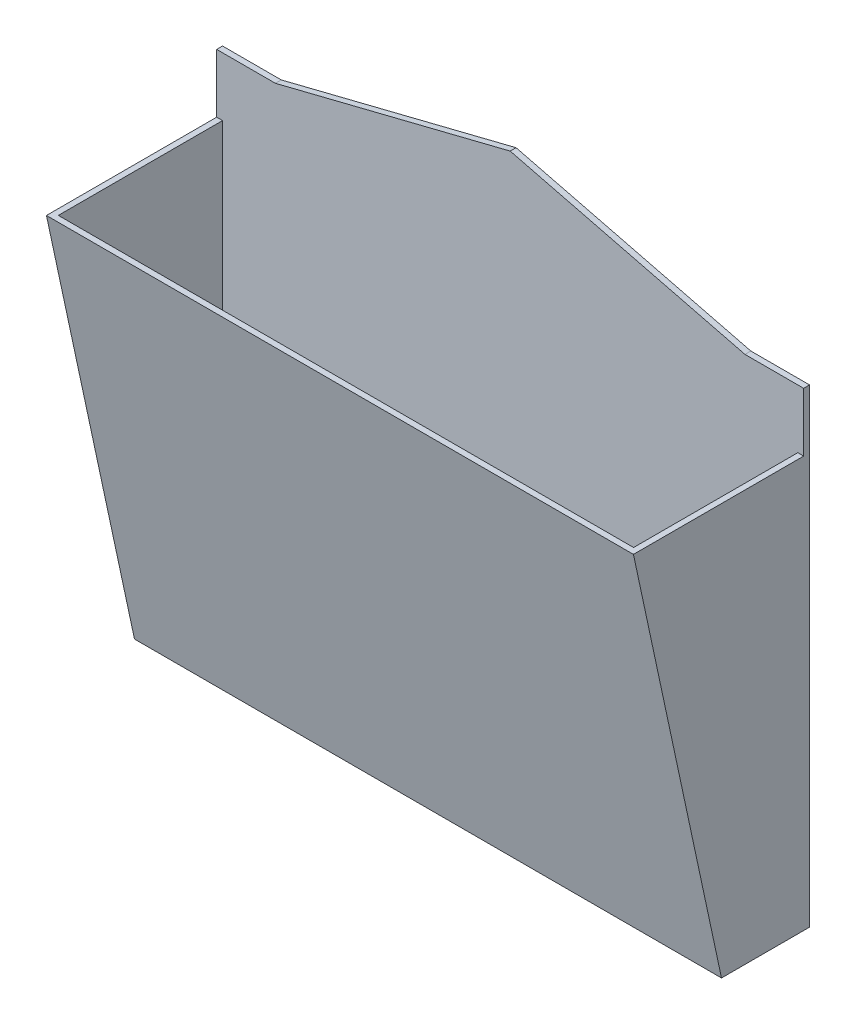
ISO-10303-21;
HEADER;
FILE_DESCRIPTION(('STEP AP214'),'2;1');
FILE_NAME('part.step','',(''),(''),'','','');
FILE_SCHEMA(('AUTOMOTIVE_DESIGN { 1 0 10303 214 1 1 1 1 }'));
ENDSEC;
DATA;
#1=APPLICATION_CONTEXT('core data for automotive mechanical design processes');
#2=APPLICATION_PROTOCOL_DEFINITION('international standard','automotive_design',2000,#1);
#3=PRODUCT_CONTEXT('',#1,'mechanical');
#4=PRODUCT('Part','Part','',(#3));
#5=PRODUCT_RELATED_PRODUCT_CATEGORY('part','',(#4));
#6=PRODUCT_DEFINITION_FORMATION('','',#4);
#7=PRODUCT_DEFINITION_CONTEXT('part definition',#1,'design');
#8=PRODUCT_DEFINITION('design','',#6,#7);
#9=PRODUCT_DEFINITION_SHAPE('','',#8);
#10=(LENGTH_UNIT() NAMED_UNIT(*) SI_UNIT(.MILLI.,.METRE.));
#11=(NAMED_UNIT(*) PLANE_ANGLE_UNIT() SI_UNIT($,.RADIAN.));
#12=(NAMED_UNIT(*) SI_UNIT($,.STERADIAN.) SOLID_ANGLE_UNIT());
#13=UNCERTAINTY_MEASURE_WITH_UNIT(LENGTH_MEASURE(1.E-05),#10,'distance_accuracy_value','');
#14=(GEOMETRIC_REPRESENTATION_CONTEXT(3) GLOBAL_UNCERTAINTY_ASSIGNED_CONTEXT((#13)) GLOBAL_UNIT_ASSIGNED_CONTEXT((#10,
#11,#12)) REPRESENTATION_CONTEXT('',''));
#15=CARTESIAN_POINT('',(0.,0.,0.));
#16=DIRECTION('',(0.,0.,1.));
#17=DIRECTION('',(1.,0.,0.));
#18=AXIS2_PLACEMENT_3D('',#15,#16,#17);
#19=CARTESIAN_POINT('',(0.,70.,30.));
#20=DIRECTION('',(0.,-1.,0.));
#21=DIRECTION('',(0.,0.,-1.));
#22=AXIS2_PLACEMENT_3D('',#19,#20,#21);
#23=PLANE('',#22);
#24=DIRECTION('',(-1.,0.,0.));
#25=VECTOR('',#24,1.);
#26=CARTESIAN_POINT('',(0.,70.,28.9772984954803));
#27=LINE('',#26,#25);
#28=CARTESIAN_POINT('',(99.,70.,28.9772984954803));
#29=VERTEX_POINT('',#28);
#30=CARTESIAN_POINT('',(1.,70.,28.9772984954803));
#31=VERTEX_POINT('',#30);
#32=EDGE_CURVE('E49',#29,#31,#27,.T.);
#33=ORIENTED_EDGE('',*,*,#32,.T.);
#34=DIRECTION('',(0.,0.,-1.));
#35=VECTOR('',#34,1.);
#36=CARTESIAN_POINT('',(1.,70.,30.));
#37=LINE('',#36,#35);
#38=CARTESIAN_POINT('',(1.,70.,1.));
#39=VERTEX_POINT('',#38);
#40=EDGE_CURVE('E162',#31,#39,#37,.T.);
#41=ORIENTED_EDGE('',*,*,#40,.T.);
#42=DIRECTION('',(1.,0.,0.));
#43=VECTOR('',#42,1.);
#44=CARTESIAN_POINT('',(0.,70.,1.));
#45=LINE('',#44,#43);
#46=CARTESIAN_POINT('',(0.,70.,1.));
#47=VERTEX_POINT('',#46);
#48=EDGE_CURVE('E57',#47,#39,#45,.T.);
#49=ORIENTED_EDGE('',*,*,#48,.F.);
#50=DIRECTION('',(0.,0.,-1.));
#51=VECTOR('',#50,1.);
#52=CARTESIAN_POINT('',(0.,70.,30.));
#53=LINE('',#52,#51);
#54=CARTESIAN_POINT('',(0.,70.,30.));
#55=VERTEX_POINT('',#54);
#56=EDGE_CURVE('E201',#55,#47,#53,.T.);
#57=ORIENTED_EDGE('',*,*,#56,.F.);
#58=DIRECTION('',(-1.,0.,0.));
#59=VECTOR('',#58,1.);
#60=CARTESIAN_POINT('',(0.,70.,30.));
#61=LINE('',#60,#59);
#62=CARTESIAN_POINT('',(100.,70.,30.));
#63=VERTEX_POINT('',#62);
#64=EDGE_CURVE('E198',#63,#55,#61,.T.);
#65=ORIENTED_EDGE('',*,*,#64,.F.);
#66=DIRECTION('',(0.,0.,-1.));
#67=VECTOR('',#66,1.);
#68=CARTESIAN_POINT('',(100.,70.,30.));
#69=LINE('',#68,#67);
#70=CARTESIAN_POINT('',(100.,70.,1.));
#71=VERTEX_POINT('',#70);
#72=EDGE_CURVE('E183',#63,#71,#69,.T.);
#73=ORIENTED_EDGE('',*,*,#72,.T.);
#74=CARTESIAN_POINT('',(99.,70.,1.));
#75=VERTEX_POINT('',#74);
#76=EDGE_CURVE('E35',#75,#71,#45,.T.);
#77=ORIENTED_EDGE('',*,*,#76,.F.);
#78=DIRECTION('',(0.,0.,-1.));
#79=VECTOR('',#78,1.);
#80=CARTESIAN_POINT('',(99.,70.,30.));
#81=LINE('',#80,#79);
#82=EDGE_CURVE('E164',#29,#75,#81,.T.);
#83=ORIENTED_EDGE('',*,*,#82,.F.);
#84=EDGE_LOOP('',(#33,#41,#49,#57,#65,#73,#77,#83));
#85=FACE_BOUND('',#84,.T.);
#86=ADVANCED_FACE('F31',(#85),#23,.F.);
#87=CARTESIAN_POINT('',(0.,0.,30.));
#88=DIRECTION('',(1.,0.,0.));
#89=DIRECTION('',(0.,0.,-1.));
#90=AXIS2_PLACEMENT_3D('',#87,#88,#89);
#91=PLANE('',#90);
#92=DIRECTION('',(0.,0.,-1.));
#93=VECTOR('',#92,1.);
#94=CARTESIAN_POINT('',(0.,0.,30.));
#95=LINE('',#94,#93);
#96=CARTESIAN_POINT('',(0.,0.,15.));
#97=VERTEX_POINT('',#96);
#98=CARTESIAN_POINT('',(0.,0.,0.));
#99=VERTEX_POINT('',#98);
#100=EDGE_CURVE('E11',#97,#99,#95,.T.);
#101=ORIENTED_EDGE('',*,*,#100,.F.);
#102=DIRECTION('',(0.,0.97780241407741,0.209529088730873));
#103=VECTOR('',#102,1.);
#104=CARTESIAN_POINT('',(0.,70.,30.));
#105=LINE('',#104,#103);
#106=EDGE_CURVE('E233',#97,#55,#105,.T.);
#107=ORIENTED_EDGE('',*,*,#106,.T.);
#108=ORIENTED_EDGE('',*,*,#56,.T.);
#109=DIRECTION('',(0.,-1.,0.));
#110=VECTOR('',#109,1.);
#111=CARTESIAN_POINT('',(0.,80.,1.));
#112=LINE('',#111,#110);
#113=CARTESIAN_POINT('',(0.,80.,1.));
#114=VERTEX_POINT('',#113);
#115=EDGE_CURVE('E173',#114,#47,#112,.T.);
#116=ORIENTED_EDGE('',*,*,#115,.F.);
#117=DIRECTION('',(0.,0.,-1.));
#118=VECTOR('',#117,1.);
#119=CARTESIAN_POINT('',(0.,80.,1.));
#120=LINE('',#119,#118);
#121=CARTESIAN_POINT('',(0.,80.,0.));
#122=VERTEX_POINT('',#121);
#123=EDGE_CURVE('E210',#114,#122,#120,.T.);
#124=ORIENTED_EDGE('',*,*,#123,.T.);
#125=DIRECTION('',(0.,-1.,0.));
#126=VECTOR('',#125,1.);
#127=CARTESIAN_POINT('',(0.,0.,0.));
#128=LINE('',#127,#126);
#129=EDGE_CURVE('E239',#122,#99,#128,.T.);
#130=ORIENTED_EDGE('',*,*,#129,.T.);
#131=EDGE_LOOP('',(#101,#107,#108,#116,#124,#130));
#132=FACE_BOUND('',#131,.T.);
#133=ADVANCED_FACE('F33',(#132),#91,.F.);
#134=CARTESIAN_POINT('',(0.,0.,30.));
#135=DIRECTION('',(0.,1.,0.));
#136=DIRECTION('',(0.,0.,1.));
#137=AXIS2_PLACEMENT_3D('',#134,#135,#136);
#138=PLANE('',#137);
#139=DIRECTION('',(0.,0.,-1.));
#140=VECTOR('',#139,1.);
#141=CARTESIAN_POINT('',(100.,0.,30.));
#142=LINE('',#141,#140);
#143=CARTESIAN_POINT('',(100.,0.,15.));
#144=VERTEX_POINT('',#143);
#145=CARTESIAN_POINT('',(100.,0.,0.));
#146=VERTEX_POINT('',#145);
#147=EDGE_CURVE('E41',#144,#146,#142,.T.);
#148=ORIENTED_EDGE('',*,*,#147,.F.);
#149=DIRECTION('',(1.,0.,0.));
#150=VECTOR('',#149,1.);
#151=CARTESIAN_POINT('',(0.,0.,15.));
#152=LINE('',#151,#150);
#153=EDGE_CURVE('E236',#97,#144,#152,.T.);
#154=ORIENTED_EDGE('',*,*,#153,.F.);
#155=ORIENTED_EDGE('',*,*,#100,.T.);
#156=DIRECTION('',(1.,0.,0.));
#157=VECTOR('',#156,1.);
#158=CARTESIAN_POINT('',(0.,0.,0.));
#159=LINE('',#158,#157);
#160=EDGE_CURVE('E243',#99,#146,#159,.T.);
#161=ORIENTED_EDGE('',*,*,#160,.T.);
#162=EDGE_LOOP('',(#148,#154,#155,#161));
#163=FACE_BOUND('',#162,.T.);
#164=ADVANCED_FACE('F254',(#163),#138,.F.);
#165=CARTESIAN_POINT('',(100.,0.,30.));
#166=DIRECTION('',(-1.,0.,0.));
#167=DIRECTION('',(0.,0.,1.));
#168=AXIS2_PLACEMENT_3D('',#165,#166,#167);
#169=PLANE('',#168);
#170=ORIENTED_EDGE('',*,*,#72,.F.);
#171=DIRECTION('',(0.,0.97780241407741,0.209529088730873));
#172=VECTOR('',#171,1.);
#173=CARTESIAN_POINT('',(100.,70.,30.));
#174=LINE('',#173,#172);
#175=EDGE_CURVE('E232',#144,#63,#174,.T.);
#176=ORIENTED_EDGE('',*,*,#175,.F.);
#177=ORIENTED_EDGE('',*,*,#147,.T.);
#178=DIRECTION('',(0.,1.,0.));
#179=VECTOR('',#178,1.);
#180=CARTESIAN_POINT('',(100.,0.,0.));
#181=LINE('',#180,#179);
#182=CARTESIAN_POINT('',(100.,80.,0.));
#183=VERTEX_POINT('',#182);
#184=EDGE_CURVE('E207',#146,#183,#181,.T.);
#185=ORIENTED_EDGE('',*,*,#184,.T.);
#186=DIRECTION('',(0.,0.,-1.));
#187=VECTOR('',#186,1.);
#188=CARTESIAN_POINT('',(100.,80.,1.));
#189=LINE('',#188,#187);
#190=CARTESIAN_POINT('',(100.,80.,1.));
#191=VERTEX_POINT('',#190);
#192=EDGE_CURVE('E204',#191,#183,#189,.T.);
#193=ORIENTED_EDGE('',*,*,#192,.F.);
#194=DIRECTION('',(0.,1.,0.));
#195=VECTOR('',#194,1.);
#196=CARTESIAN_POINT('',(100.,80.,1.));
#197=LINE('',#196,#195);
#198=EDGE_CURVE('E182',#71,#191,#197,.T.);
#199=ORIENTED_EDGE('',*,*,#198,.F.);
#200=EDGE_LOOP('',(#170,#176,#177,#185,#193,#199));
#201=FACE_BOUND('',#200,.T.);
#202=ADVANCED_FACE('F202',(#201),#169,.F.);
#203=CARTESIAN_POINT('',(0.,70.,0.));
#204=DIRECTION('',(0.,0.,-1.));
#205=DIRECTION('',(-1.,0.,0.));
#206=AXIS2_PLACEMENT_3D('',#203,#204,#205);
#207=PLANE('',#206);
#208=ORIENTED_EDGE('',*,*,#129,.F.);
#209=DIRECTION('',(-1.,0.,0.));
#210=VECTOR('',#209,1.);
#211=CARTESIAN_POINT('',(10.,80.,0.));
#212=LINE('',#211,#210);
#213=CARTESIAN_POINT('',(10.,80.,0.));
#214=VERTEX_POINT('',#213);
#215=EDGE_CURVE('E258',#214,#122,#212,.T.);
#216=ORIENTED_EDGE('',*,*,#215,.F.);
#217=DIRECTION('',(-0.970142500145332,-0.242535625036333,0.));
#218=VECTOR('',#217,1.);
#219=CARTESIAN_POINT('',(50.,90.,0.));
#220=LINE('',#219,#218);
#221=CARTESIAN_POINT('',(50.,90.,0.));
#222=VERTEX_POINT('',#221);
#223=EDGE_CURVE('E260',#222,#214,#220,.T.);
#224=ORIENTED_EDGE('',*,*,#223,.F.);
#225=DIRECTION('',(-0.970142500145332,0.242535625036333,0.));
#226=VECTOR('',#225,1.);
#227=CARTESIAN_POINT('',(50.,90.,0.));
#228=LINE('',#227,#226);
#229=CARTESIAN_POINT('',(90.,80.,0.));
#230=VERTEX_POINT('',#229);
#231=EDGE_CURVE('E149',#230,#222,#228,.T.);
#232=ORIENTED_EDGE('',*,*,#231,.F.);
#233=DIRECTION('',(-1.,0.,0.));
#234=VECTOR('',#233,1.);
#235=CARTESIAN_POINT('',(90.,80.,0.));
#236=LINE('',#235,#234);
#237=EDGE_CURVE('E170',#183,#230,#236,.T.);
#238=ORIENTED_EDGE('',*,*,#237,.F.);
#239=ORIENTED_EDGE('',*,*,#184,.F.);
#240=ORIENTED_EDGE('',*,*,#160,.F.);
#241=EDGE_LOOP('',(#208,#216,#224,#232,#238,#239,#240));
#242=FACE_BOUND('',#241,.T.);
#243=ADVANCED_FACE('F257',(#242),#207,.T.);
#244=CARTESIAN_POINT('',(0.,70.,30.));
#245=DIRECTION('',(0.,0.209529088730873,-0.97780241407741));
#246=DIRECTION('',(0.,0.97780241407741,0.209529088730873));
#247=AXIS2_PLACEMENT_3D('',#244,#245,#246);
#248=PLANE('',#247);
#249=ORIENTED_EDGE('',*,*,#175,.T.);
#250=ORIENTED_EDGE('',*,*,#64,.T.);
#251=ORIENTED_EDGE('',*,*,#106,.F.);
#252=ORIENTED_EDGE('',*,*,#153,.T.);
#253=EDGE_LOOP('',(#249,#250,#251,#252));
#254=FACE_BOUND('',#253,.T.);
#255=ADVANCED_FACE('F274',(#254),#248,.F.);
#256=CARTESIAN_POINT('',(50.,90.,1.));
#257=DIRECTION('',(-0.242535625036333,-0.970142500145332,0.));
#258=DIRECTION('',(0.970142500145332,-0.242535625036333,0.));
#259=AXIS2_PLACEMENT_3D('',#256,#257,#258);
#260=PLANE('',#259);
#261=ORIENTED_EDGE('',*,*,#231,.T.);
#262=DIRECTION('',(0.,0.,-1.));
#263=VECTOR('',#262,1.);
#264=CARTESIAN_POINT('',(50.,90.,1.));
#265=LINE('',#264,#263);
#266=CARTESIAN_POINT('',(50.,90.,1.));
#267=VERTEX_POINT('',#266);
#268=EDGE_CURVE('E229',#267,#222,#265,.T.);
#269=ORIENTED_EDGE('',*,*,#268,.F.);
#270=DIRECTION('',(-0.970142500145332,0.242535625036333,0.));
#271=VECTOR('',#270,1.);
#272=CARTESIAN_POINT('',(50.,90.,1.));
#273=LINE('',#272,#271);
#274=CARTESIAN_POINT('',(90.,80.,1.));
#275=VERTEX_POINT('',#274);
#276=EDGE_CURVE('E167',#275,#267,#273,.T.);
#277=ORIENTED_EDGE('',*,*,#276,.F.);
#278=DIRECTION('',(0.,0.,-1.));
#279=VECTOR('',#278,1.);
#280=CARTESIAN_POINT('',(90.,80.,1.));
#281=LINE('',#280,#279);
#282=EDGE_CURVE('E211',#275,#230,#281,.T.);
#283=ORIENTED_EDGE('',*,*,#282,.T.);
#284=EDGE_LOOP('',(#261,#269,#277,#283));
#285=FACE_BOUND('',#284,.T.);
#286=ADVANCED_FACE('F266',(#285),#260,.F.);
#287=CARTESIAN_POINT('',(50.,90.,1.));
#288=DIRECTION('',(0.242535625036333,-0.970142500145332,0.));
#289=DIRECTION('',(0.970142500145332,0.242535625036333,0.));
#290=AXIS2_PLACEMENT_3D('',#287,#288,#289);
#291=PLANE('',#290);
#292=ORIENTED_EDGE('',*,*,#223,.T.);
#293=DIRECTION('',(0.,0.,-1.));
#294=VECTOR('',#293,1.);
#295=CARTESIAN_POINT('',(10.,80.,1.));
#296=LINE('',#295,#294);
#297=CARTESIAN_POINT('',(10.,80.,1.));
#298=VERTEX_POINT('',#297);
#299=EDGE_CURVE('E226',#298,#214,#296,.T.);
#300=ORIENTED_EDGE('',*,*,#299,.F.);
#301=DIRECTION('',(-0.970142500145332,-0.242535625036333,0.));
#302=VECTOR('',#301,1.);
#303=CARTESIAN_POINT('',(50.,90.,1.));
#304=LINE('',#303,#302);
#305=EDGE_CURVE('E169',#267,#298,#304,.T.);
#306=ORIENTED_EDGE('',*,*,#305,.F.);
#307=ORIENTED_EDGE('',*,*,#268,.T.);
#308=EDGE_LOOP('',(#292,#300,#306,#307));
#309=FACE_BOUND('',#308,.T.);
#310=ADVANCED_FACE('F268',(#309),#291,.F.);
#311=CARTESIAN_POINT('',(10.,80.,1.));
#312=DIRECTION('',(0.,-1.,0.));
#313=DIRECTION('',(0.,0.,-1.));
#314=AXIS2_PLACEMENT_3D('',#311,#312,#313);
#315=PLANE('',#314);
#316=ORIENTED_EDGE('',*,*,#215,.T.);
#317=ORIENTED_EDGE('',*,*,#123,.F.);
#318=DIRECTION('',(-1.,0.,0.));
#319=VECTOR('',#318,1.);
#320=CARTESIAN_POINT('',(10.,80.,1.));
#321=LINE('',#320,#319);
#322=EDGE_CURVE('E172',#298,#114,#321,.T.);
#323=ORIENTED_EDGE('',*,*,#322,.F.);
#324=ORIENTED_EDGE('',*,*,#299,.T.);
#325=EDGE_LOOP('',(#316,#317,#323,#324));
#326=FACE_BOUND('',#325,.T.);
#327=ADVANCED_FACE('F271',(#326),#315,.F.);
#328=CARTESIAN_POINT('',(90.,80.,1.));
#329=DIRECTION('',(0.,-1.,0.));
#330=DIRECTION('',(0.,0.,-1.));
#331=AXIS2_PLACEMENT_3D('',#328,#329,#330);
#332=PLANE('',#331);
#333=ORIENTED_EDGE('',*,*,#237,.T.);
#334=ORIENTED_EDGE('',*,*,#282,.F.);
#335=DIRECTION('',(-1.,0.,0.));
#336=VECTOR('',#335,1.);
#337=CARTESIAN_POINT('',(90.,80.,1.));
#338=LINE('',#337,#336);
#339=EDGE_CURVE('E176',#191,#275,#338,.T.);
#340=ORIENTED_EDGE('',*,*,#339,.F.);
#341=ORIENTED_EDGE('',*,*,#192,.T.);
#342=EDGE_LOOP('',(#333,#334,#340,#341));
#343=FACE_BOUND('',#342,.T.);
#344=ADVANCED_FACE('F214',(#343),#332,.F.);
#345=CARTESIAN_POINT('',(100.,77.5,1.));
#346=DIRECTION('',(0.,0.,-1.));
#347=DIRECTION('',(-1.,0.,0.));
#348=AXIS2_PLACEMENT_3D('',#345,#346,#347);
#349=PLANE('',#348);
#350=ORIENTED_EDGE('',*,*,#276,.T.);
#351=ORIENTED_EDGE('',*,*,#305,.T.);
#352=ORIENTED_EDGE('',*,*,#322,.T.);
#353=ORIENTED_EDGE('',*,*,#115,.T.);
#354=ORIENTED_EDGE('',*,*,#48,.T.);
#355=DIRECTION('',(0.,-1.,0.));
#356=VECTOR('',#355,1.);
#357=CARTESIAN_POINT('',(1.,70.,1.));
#358=LINE('',#357,#356);
#359=CARTESIAN_POINT('',(1.,1.,1.));
#360=VERTEX_POINT('',#359);
#361=EDGE_CURVE('E130',#39,#360,#358,.T.);
#362=ORIENTED_EDGE('',*,*,#361,.T.);
#363=DIRECTION('',(1.,0.,0.));
#364=VECTOR('',#363,1.);
#365=CARTESIAN_POINT('',(0.,1.,1.));
#366=LINE('',#365,#364);
#367=CARTESIAN_POINT('',(99.,1.,1.));
#368=VERTEX_POINT('',#367);
#369=EDGE_CURVE('E136',#360,#368,#366,.T.);
#370=ORIENTED_EDGE('',*,*,#369,.T.);
#371=DIRECTION('',(0.,1.,0.));
#372=VECTOR('',#371,1.);
#373=CARTESIAN_POINT('',(99.,70.,1.));
#374=LINE('',#373,#372);
#375=EDGE_CURVE('E154',#368,#75,#374,.T.);
#376=ORIENTED_EDGE('',*,*,#375,.T.);
#377=ORIENTED_EDGE('',*,*,#76,.T.);
#378=ORIENTED_EDGE('',*,*,#198,.T.);
#379=ORIENTED_EDGE('',*,*,#339,.T.);
#380=EDGE_LOOP('',(#350,#351,#352,#353,#354,#362,#370,#376,#377,#378,#379));
#381=FACE_BOUND('',#380,.T.);
#382=ADVANCED_FACE('F133',(#381),#349,.F.);
#383=CARTESIAN_POINT('',(1.,0.,30.));
#384=DIRECTION('',(1.,0.,0.));
#385=DIRECTION('',(0.,0.,-1.));
#386=AXIS2_PLACEMENT_3D('',#383,#384,#385);
#387=PLANE('',#386);
#388=DIRECTION('',(0.,0.,-1.));
#389=VECTOR('',#388,1.);
#390=CARTESIAN_POINT('',(1.,1.,30.));
#391=LINE('',#390,#389);
#392=CARTESIAN_POINT('',(1.,1.,14.191584209766));
#393=VERTEX_POINT('',#392);
#394=EDGE_CURVE('E144',#393,#360,#391,.T.);
#395=ORIENTED_EDGE('',*,*,#394,.T.);
#396=ORIENTED_EDGE('',*,*,#361,.F.);
#397=ORIENTED_EDGE('',*,*,#40,.F.);
#398=DIRECTION('',(0.,0.97780241407741,0.209529088730873));
#399=VECTOR('',#398,1.);
#400=CARTESIAN_POINT('',(1.,3.28269982043819,14.6807341712884));
#401=LINE('',#400,#399);
#402=EDGE_CURVE('E146',#393,#31,#401,.T.);
#403=ORIENTED_EDGE('',*,*,#402,.F.);
#404=EDGE_LOOP('',(#395,#396,#397,#403));
#405=FACE_BOUND('',#404,.T.);
#406=ADVANCED_FACE('F145',(#405),#387,.T.);
#407=CARTESIAN_POINT('',(0.,1.,30.));
#408=DIRECTION('',(0.,1.,0.));
#409=DIRECTION('',(0.,0.,1.));
#410=AXIS2_PLACEMENT_3D('',#407,#408,#409);
#411=PLANE('',#410);
#412=DIRECTION('',(0.,0.,-1.));
#413=VECTOR('',#412,1.);
#414=CARTESIAN_POINT('',(99.,1.,30.));
#415=LINE('',#414,#413);
#416=CARTESIAN_POINT('',(99.,1.,14.191584209766));
#417=VERTEX_POINT('',#416);
#418=EDGE_CURVE('E150',#417,#368,#415,.T.);
#419=ORIENTED_EDGE('',*,*,#418,.T.);
#420=ORIENTED_EDGE('',*,*,#369,.F.);
#421=ORIENTED_EDGE('',*,*,#394,.F.);
#422=DIRECTION('',(1.,0.,0.));
#423=VECTOR('',#422,1.);
#424=CARTESIAN_POINT('',(0.,1.,14.191584209766));
#425=LINE('',#424,#423);
#426=EDGE_CURVE('E141',#393,#417,#425,.T.);
#427=ORIENTED_EDGE('',*,*,#426,.T.);
#428=EDGE_LOOP('',(#419,#420,#421,#427));
#429=FACE_BOUND('',#428,.T.);
#430=ADVANCED_FACE('F152',(#429),#411,.T.);
#431=CARTESIAN_POINT('',(99.,0.,30.));
#432=DIRECTION('',(-1.,0.,0.));
#433=DIRECTION('',(0.,0.,1.));
#434=AXIS2_PLACEMENT_3D('',#431,#432,#433);
#435=PLANE('',#434);
#436=ORIENTED_EDGE('',*,*,#375,.F.);
#437=ORIENTED_EDGE('',*,*,#418,.F.);
#438=DIRECTION('',(0.,0.97780241407741,0.209529088730873));
#439=VECTOR('',#438,1.);
#440=CARTESIAN_POINT('',(99.,70.2095290887309,29.0221975859226));
#441=LINE('',#440,#439);
#442=EDGE_CURVE('E160',#417,#29,#441,.T.);
#443=ORIENTED_EDGE('',*,*,#442,.T.);
#444=ORIENTED_EDGE('',*,*,#82,.T.);
#445=EDGE_LOOP('',(#436,#437,#443,#444));
#446=FACE_BOUND('',#445,.T.);
#447=ADVANCED_FACE('F367',(#446),#435,.T.);
#448=CARTESIAN_POINT('',(0.,70.2095290887309,29.0221975859226));
#449=DIRECTION('',(0.,0.209529088730873,-0.97780241407741));
#450=DIRECTION('',(0.,0.97780241407741,0.209529088730873));
#451=AXIS2_PLACEMENT_3D('',#448,#449,#450);
#452=PLANE('',#451);
#453=ORIENTED_EDGE('',*,*,#442,.F.);
#454=ORIENTED_EDGE('',*,*,#426,.F.);
#455=ORIENTED_EDGE('',*,*,#402,.T.);
#456=ORIENTED_EDGE('',*,*,#32,.F.);
#457=EDGE_LOOP('',(#453,#454,#455,#456));
#458=FACE_BOUND('',#457,.T.);
#459=ADVANCED_FACE('F377',(#458),#452,.T.);
#460=CLOSED_SHELL('',(#86,#133,#164,#202,#243,#255,#286,#310,#327,#344,#382,#406,#430,#447,#459));
#461=MANIFOLD_SOLID_BREP('B2',#460);
#462=ADVANCED_BREP_SHAPE_REPRESENTATION('',(#18,#461),#14);
#463=SHAPE_DEFINITION_REPRESENTATION(#9,#462);
ENDSEC;
END-ISO-10303-21;
